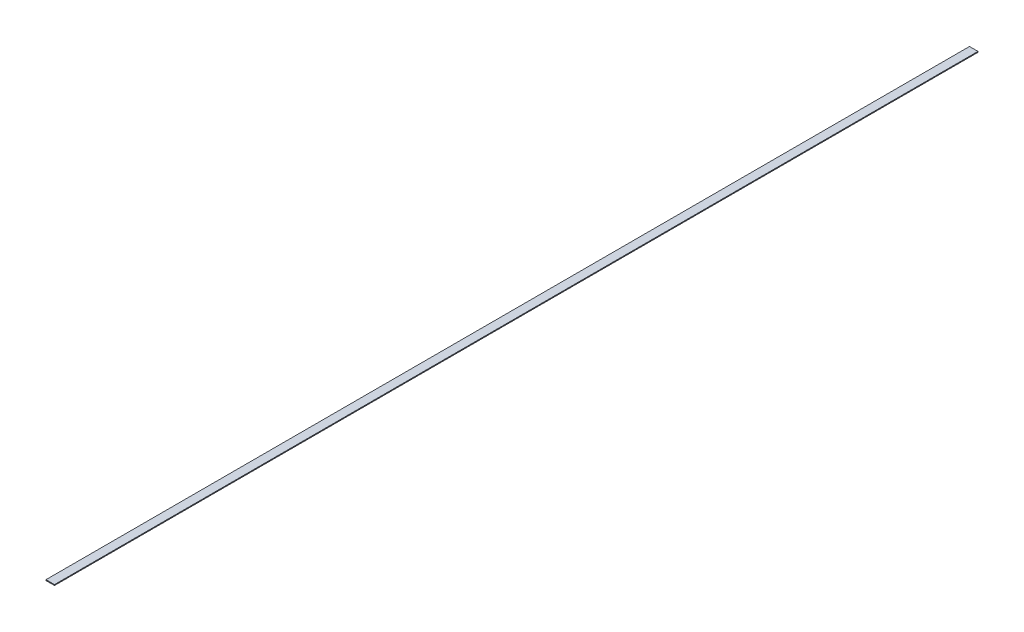
ISO-10303-21;
HEADER;
FILE_DESCRIPTION(('STEP AP214'),'2;1');
FILE_NAME('part.step','',(''),(''),'','','');
FILE_SCHEMA(('AUTOMOTIVE_DESIGN { 1 0 10303 214 1 1 1 1 }'));
ENDSEC;
DATA;
#1=APPLICATION_CONTEXT('core data for automotive mechanical design processes');
#2=APPLICATION_PROTOCOL_DEFINITION('international standard','automotive_design',2000,#1);
#3=PRODUCT_CONTEXT('',#1,'mechanical');
#4=PRODUCT('Part','Part','',(#3));
#5=PRODUCT_RELATED_PRODUCT_CATEGORY('part','',(#4));
#6=PRODUCT_DEFINITION_FORMATION('','',#4);
#7=PRODUCT_DEFINITION_CONTEXT('part definition',#1,'design');
#8=PRODUCT_DEFINITION('design','',#6,#7);
#9=PRODUCT_DEFINITION_SHAPE('','',#8);
#10=(LENGTH_UNIT() NAMED_UNIT(*) SI_UNIT(.MILLI.,.METRE.));
#11=(NAMED_UNIT(*) PLANE_ANGLE_UNIT() SI_UNIT($,.RADIAN.));
#12=(NAMED_UNIT(*) SI_UNIT($,.STERADIAN.) SOLID_ANGLE_UNIT());
#13=UNCERTAINTY_MEASURE_WITH_UNIT(LENGTH_MEASURE(1.E-05),#10,'distance_accuracy_value','');
#14=(GEOMETRIC_REPRESENTATION_CONTEXT(3) GLOBAL_UNCERTAINTY_ASSIGNED_CONTEXT((#13)) GLOBAL_UNIT_ASSIGNED_CONTEXT((#10,
#11,#12)) REPRESENTATION_CONTEXT('',''));
#15=CARTESIAN_POINT('',(0.,0.,0.));
#16=DIRECTION('',(0.,0.,1.));
#17=DIRECTION('',(1.,0.,0.));
#18=AXIS2_PLACEMENT_3D('',#15,#16,#17);
#19=CARTESIAN_POINT('',(0.,5.08,0.));
#20=DIRECTION('',(1.,0.,0.));
#21=DIRECTION('',(0.,0.,-1.));
#22=AXIS2_PLACEMENT_3D('',#19,#20,#21);
#23=PLANE('',#22);
#24=DIRECTION('',(0.,0.,1.));
#25=VECTOR('',#24,1.);
#26=CARTESIAN_POINT('',(0.,0.,0.));
#27=LINE('',#26,#25);
#28=CARTESIAN_POINT('',(0.,0.,-5518.15));
#29=VERTEX_POINT('',#28);
#30=CARTESIAN_POINT('',(0.,0.,0.));
#31=VERTEX_POINT('',#30);
#32=EDGE_CURVE('E100',#29,#31,#27,.T.);
#33=ORIENTED_EDGE('',*,*,#32,.T.);
#34=DIRECTION('',(0.,-1.,0.));
#35=VECTOR('',#34,1.);
#36=CARTESIAN_POINT('',(0.,5.08,0.));
#37=LINE('',#36,#35);
#38=CARTESIAN_POINT('',(0.,5.08,0.));
#39=VERTEX_POINT('',#38);
#40=EDGE_CURVE('E11',#39,#31,#37,.T.);
#41=ORIENTED_EDGE('',*,*,#40,.F.);
#42=DIRECTION('',(0.,0.,1.));
#43=VECTOR('',#42,1.);
#44=CARTESIAN_POINT('',(0.,5.08,0.));
#45=LINE('',#44,#43);
#46=CARTESIAN_POINT('',(0.,5.08,-5518.15));
#47=VERTEX_POINT('',#46);
#48=EDGE_CURVE('E88',#47,#39,#45,.T.);
#49=ORIENTED_EDGE('',*,*,#48,.F.);
#50=DIRECTION('',(0.,-1.,0.));
#51=VECTOR('',#50,1.);
#52=CARTESIAN_POINT('',(0.,5.08,-5518.15));
#53=LINE('',#52,#51);
#54=EDGE_CURVE('E96',#47,#29,#53,.T.);
#55=ORIENTED_EDGE('',*,*,#54,.T.);
#56=EDGE_LOOP('',(#33,#41,#49,#55));
#57=FACE_BOUND('',#56,.T.);
#58=ADVANCED_FACE('F37',(#57),#23,.F.);
#59=CARTESIAN_POINT('',(0.,5.08,0.));
#60=DIRECTION('',(0.,0.,-1.));
#61=DIRECTION('',(-1.,0.,0.));
#62=AXIS2_PLACEMENT_3D('',#59,#60,#61);
#63=PLANE('',#62);
#64=DIRECTION('',(1.,0.,0.));
#65=VECTOR('',#64,1.);
#66=CARTESIAN_POINT('',(0.,0.,0.));
#67=LINE('',#66,#65);
#68=CARTESIAN_POINT('',(50.8,0.,0.));
#69=VERTEX_POINT('',#68);
#70=EDGE_CURVE('E92',#31,#69,#67,.T.);
#71=ORIENTED_EDGE('',*,*,#70,.T.);
#72=DIRECTION('',(0.,-1.,0.));
#73=VECTOR('',#72,1.);
#74=CARTESIAN_POINT('',(50.8,5.08,0.));
#75=LINE('',#74,#73);
#76=CARTESIAN_POINT('',(50.8,5.08,0.));
#77=VERTEX_POINT('',#76);
#78=EDGE_CURVE('E45',#77,#69,#75,.T.);
#79=ORIENTED_EDGE('',*,*,#78,.F.);
#80=DIRECTION('',(1.,0.,0.));
#81=VECTOR('',#80,1.);
#82=CARTESIAN_POINT('',(0.,5.08,0.));
#83=LINE('',#82,#81);
#84=EDGE_CURVE('E83',#39,#77,#83,.T.);
#85=ORIENTED_EDGE('',*,*,#84,.F.);
#86=ORIENTED_EDGE('',*,*,#40,.T.);
#87=EDGE_LOOP('',(#71,#79,#85,#86));
#88=FACE_BOUND('',#87,.T.);
#89=ADVANCED_FACE('F91',(#88),#63,.F.);
#90=CARTESIAN_POINT('',(50.8,5.08,0.));
#91=DIRECTION('',(-1.,0.,0.));
#92=DIRECTION('',(0.,0.,1.));
#93=AXIS2_PLACEMENT_3D('',#90,#91,#92);
#94=PLANE('',#93);
#95=DIRECTION('',(0.,0.,-1.));
#96=VECTOR('',#95,1.);
#97=CARTESIAN_POINT('',(50.8,0.,0.));
#98=LINE('',#97,#96);
#99=CARTESIAN_POINT('',(50.8,0.,-5518.15));
#100=VERTEX_POINT('',#99);
#101=EDGE_CURVE('E70',#69,#100,#98,.T.);
#102=ORIENTED_EDGE('',*,*,#101,.T.);
#103=DIRECTION('',(0.,-1.,0.));
#104=VECTOR('',#103,1.);
#105=CARTESIAN_POINT('',(50.8,5.08,-5518.15));
#106=LINE('',#105,#104);
#107=CARTESIAN_POINT('',(50.8,5.08,-5518.15));
#108=VERTEX_POINT('',#107);
#109=EDGE_CURVE('E93',#108,#100,#106,.T.);
#110=ORIENTED_EDGE('',*,*,#109,.F.);
#111=DIRECTION('',(0.,0.,-1.));
#112=VECTOR('',#111,1.);
#113=CARTESIAN_POINT('',(50.8,5.08,0.));
#114=LINE('',#113,#112);
#115=EDGE_CURVE('E86',#77,#108,#114,.T.);
#116=ORIENTED_EDGE('',*,*,#115,.F.);
#117=ORIENTED_EDGE('',*,*,#78,.T.);
#118=EDGE_LOOP('',(#102,#110,#116,#117));
#119=FACE_BOUND('',#118,.T.);
#120=ADVANCED_FACE('F94',(#119),#94,.F.);
#121=CARTESIAN_POINT('',(0.,5.08,-5518.15));
#122=DIRECTION('',(0.,0.,1.));
#123=DIRECTION('',(1.,0.,0.));
#124=AXIS2_PLACEMENT_3D('',#121,#122,#123);
#125=PLANE('',#124);
#126=DIRECTION('',(-1.,0.,0.));
#127=VECTOR('',#126,1.);
#128=CARTESIAN_POINT('',(0.,0.,-5518.15));
#129=LINE('',#128,#127);
#130=EDGE_CURVE('E76',#100,#29,#129,.T.);
#131=ORIENTED_EDGE('',*,*,#130,.T.);
#132=ORIENTED_EDGE('',*,*,#54,.F.);
#133=DIRECTION('',(-1.,0.,0.));
#134=VECTOR('',#133,1.);
#135=CARTESIAN_POINT('',(0.,5.08,-5518.15));
#136=LINE('',#135,#134);
#137=EDGE_CURVE('E53',#108,#47,#136,.T.);
#138=ORIENTED_EDGE('',*,*,#137,.F.);
#139=ORIENTED_EDGE('',*,*,#109,.T.);
#140=EDGE_LOOP('',(#131,#132,#138,#139));
#141=FACE_BOUND('',#140,.T.);
#142=ADVANCED_FACE('F107',(#141),#125,.F.);
#143=CARTESIAN_POINT('',(0.,5.08,0.));
#144=DIRECTION('',(0.,-1.,0.));
#145=DIRECTION('',(0.,0.,-1.));
#146=AXIS2_PLACEMENT_3D('',#143,#144,#145);
#147=PLANE('',#146);
#148=ORIENTED_EDGE('',*,*,#48,.T.);
#149=ORIENTED_EDGE('',*,*,#84,.T.);
#150=ORIENTED_EDGE('',*,*,#115,.T.);
#151=ORIENTED_EDGE('',*,*,#137,.T.);
#152=EDGE_LOOP('',(#148,#149,#150,#151));
#153=FACE_BOUND('',#152,.T.);
#154=ADVANCED_FACE('F84',(#153),#147,.F.);
#155=CARTESIAN_POINT('',(0.,0.,0.));
#156=DIRECTION('',(0.,-1.,0.));
#157=DIRECTION('',(0.,0.,-1.));
#158=AXIS2_PLACEMENT_3D('',#155,#156,#157);
#159=PLANE('',#158);
#160=ORIENTED_EDGE('',*,*,#32,.F.);
#161=ORIENTED_EDGE('',*,*,#130,.F.);
#162=ORIENTED_EDGE('',*,*,#101,.F.);
#163=ORIENTED_EDGE('',*,*,#70,.F.);
#164=EDGE_LOOP('',(#160,#161,#162,#163));
#165=FACE_BOUND('',#164,.T.);
#166=ADVANCED_FACE('F110',(#165),#159,.T.);
#167=CLOSED_SHELL('',(#58,#89,#120,#142,#154,#166));
#168=MANIFOLD_SOLID_BREP('B2',#167);
#169=ADVANCED_BREP_SHAPE_REPRESENTATION('',(#18,#168),#14);
#170=SHAPE_DEFINITION_REPRESENTATION(#9,#169);
ENDSEC;
END-ISO-10303-21;
